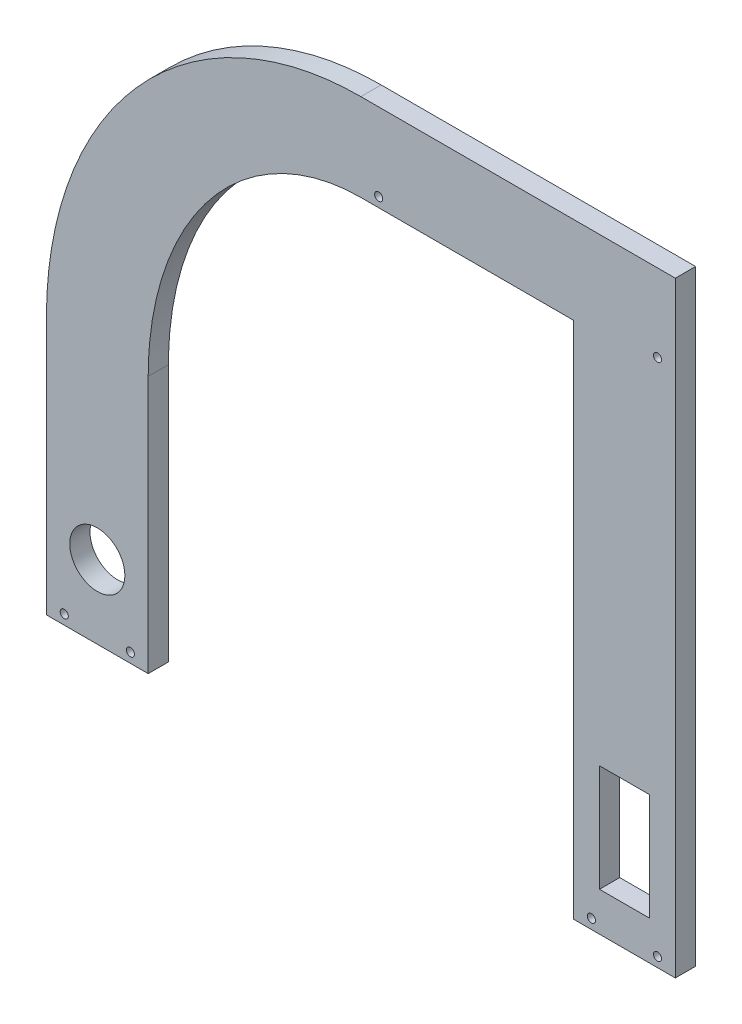
ISO-10303-21;
HEADER;
FILE_DESCRIPTION(('STEP AP214'),'2;1');
FILE_NAME('part.step','',(''),(''),'','','');
FILE_SCHEMA(('AUTOMOTIVE_DESIGN { 1 0 10303 214 1 1 1 1 }'));
ENDSEC;
DATA;
#1=APPLICATION_CONTEXT('core data for automotive mechanical design processes');
#2=APPLICATION_PROTOCOL_DEFINITION('international standard','automotive_design',2000,#1);
#3=PRODUCT_CONTEXT('',#1,'mechanical');
#4=PRODUCT('Part','Part','',(#3));
#5=PRODUCT_RELATED_PRODUCT_CATEGORY('part','',(#4));
#6=PRODUCT_DEFINITION_FORMATION('','',#4);
#7=PRODUCT_DEFINITION_CONTEXT('part definition',#1,'design');
#8=PRODUCT_DEFINITION('design','',#6,#7);
#9=PRODUCT_DEFINITION_SHAPE('','',#8);
#10=(LENGTH_UNIT() NAMED_UNIT(*) SI_UNIT(.MILLI.,.METRE.));
#11=(NAMED_UNIT(*) PLANE_ANGLE_UNIT() SI_UNIT($,.RADIAN.));
#12=(NAMED_UNIT(*) SI_UNIT($,.STERADIAN.) SOLID_ANGLE_UNIT());
#13=UNCERTAINTY_MEASURE_WITH_UNIT(LENGTH_MEASURE(1.E-05),#10,'distance_accuracy_value','');
#14=(GEOMETRIC_REPRESENTATION_CONTEXT(3) GLOBAL_UNCERTAINTY_ASSIGNED_CONTEXT((#13)) GLOBAL_UNIT_ASSIGNED_CONTEXT((#10,
#11,#12)) REPRESENTATION_CONTEXT('',''));
#15=CARTESIAN_POINT('',(0.,0.,0.));
#16=DIRECTION('',(0.,0.,1.));
#17=DIRECTION('',(1.,0.,0.));
#18=AXIS2_PLACEMENT_3D('',#15,#16,#17);
#19=CARTESIAN_POINT('',(0.,0.,7.9375));
#20=DIRECTION('',(1.,0.,0.));
#21=DIRECTION('',(0.,0.,-1.));
#22=AXIS2_PLACEMENT_3D('',#19,#20,#21);
#23=PLANE('',#22);
#24=DIRECTION('',(0.,0.,1.));
#25=VECTOR('',#24,1.);
#26=CARTESIAN_POINT('',(0.,100.875137361259,-0.000999999999999265));
#27=LINE('',#26,#25);
#28=CARTESIAN_POINT('',(0.,100.875137361259,0.));
#29=VERTEX_POINT('',#28);
#30=CARTESIAN_POINT('',(0.,100.875137361259,7.9375));
#31=VERTEX_POINT('',#30);
#32=EDGE_CURVE('E363',#29,#31,#27,.T.);
#33=ORIENTED_EDGE('',*,*,#32,.F.);
#34=DIRECTION('',(0.,-1.,0.));
#35=VECTOR('',#34,1.);
#36=CARTESIAN_POINT('',(0.,0.,0.));
#37=LINE('',#36,#35);
#38=CARTESIAN_POINT('',(0.,0.,0.));
#39=VERTEX_POINT('',#38);
#40=EDGE_CURVE('E312',#29,#39,#37,.T.);
#41=ORIENTED_EDGE('',*,*,#40,.T.);
#42=DIRECTION('',(0.,0.,-1.));
#43=VECTOR('',#42,1.);
#44=CARTESIAN_POINT('',(0.,0.,7.9375));
#45=LINE('',#44,#43);
#46=CARTESIAN_POINT('',(0.,0.,7.9375));
#47=VERTEX_POINT('',#46);
#48=EDGE_CURVE('E11',#47,#39,#45,.T.);
#49=ORIENTED_EDGE('',*,*,#48,.F.);
#50=DIRECTION('',(0.,-1.,0.));
#51=VECTOR('',#50,1.);
#52=CARTESIAN_POINT('',(0.,0.,7.9375));
#53=LINE('',#52,#51);
#54=EDGE_CURVE('E313',#31,#47,#53,.T.);
#55=ORIENTED_EDGE('',*,*,#54,.F.);
#56=EDGE_LOOP('',(#33,#41,#49,#55));
#57=FACE_BOUND('',#56,.T.);
#58=ADVANCED_FACE('F38',(#57),#23,.F.);
#59=CARTESIAN_POINT('',(0.,0.,7.9375));
#60=DIRECTION('',(0.,1.,0.));
#61=DIRECTION('',(0.,0.,1.));
#62=AXIS2_PLACEMENT_3D('',#59,#60,#61);
#63=PLANE('',#62);
#64=DIRECTION('',(1.,0.,0.));
#65=VECTOR('',#64,1.);
#66=CARTESIAN_POINT('',(0.,0.,0.));
#67=LINE('',#66,#65);
#68=CARTESIAN_POINT('',(39.878,0.,0.));
#69=VERTEX_POINT('',#68);
#70=EDGE_CURVE('E329',#39,#69,#67,.T.);
#71=ORIENTED_EDGE('',*,*,#70,.T.);
#72=DIRECTION('',(0.,0.,1.));
#73=VECTOR('',#72,1.);
#74=CARTESIAN_POINT('',(39.878,0.,-0.000999999999999265));
#75=LINE('',#74,#73);
#76=CARTESIAN_POINT('',(39.878,0.,7.9375));
#77=VERTEX_POINT('',#76);
#78=EDGE_CURVE('E293',#69,#77,#75,.T.);
#79=ORIENTED_EDGE('',*,*,#78,.T.);
#80=DIRECTION('',(1.,0.,0.));
#81=VECTOR('',#80,1.);
#82=CARTESIAN_POINT('',(0.,0.,7.9375));
#83=LINE('',#82,#81);
#84=EDGE_CURVE('E318',#47,#77,#83,.T.);
#85=ORIENTED_EDGE('',*,*,#84,.F.);
#86=ORIENTED_EDGE('',*,*,#48,.T.);
#87=EDGE_LOOP('',(#71,#79,#85,#86));
#88=FACE_BOUND('',#87,.T.);
#89=ADVANCED_FACE('F374',(#88),#63,.F.);
#90=CARTESIAN_POINT('',(206.502,0.,7.9375));
#91=VERTEX_POINT('',#90);
#92=CARTESIAN_POINT('',(246.38,0.,7.9375));
#93=VERTEX_POINT('',#92);
#94=EDGE_CURVE('E316',#91,#93,#83,.T.);
#95=ORIENTED_EDGE('',*,*,#94,.F.);
#96=DIRECTION('',(0.,0.,1.));
#97=VECTOR('',#96,1.);
#98=CARTESIAN_POINT('',(206.502,0.,-0.000999999999999265));
#99=LINE('',#98,#97);
#100=CARTESIAN_POINT('',(206.502,0.,0.));
#101=VERTEX_POINT('',#100);
#102=EDGE_CURVE('E292',#101,#91,#99,.T.);
#103=ORIENTED_EDGE('',*,*,#102,.F.);
#104=CARTESIAN_POINT('',(246.38,0.,0.));
#105=VERTEX_POINT('',#104);
#106=EDGE_CURVE('E328',#101,#105,#67,.T.);
#107=ORIENTED_EDGE('',*,*,#106,.T.);
#108=DIRECTION('',(0.,0.,-1.));
#109=VECTOR('',#108,1.);
#110=CARTESIAN_POINT('',(246.38,0.,7.9375));
#111=LINE('',#110,#109);
#112=EDGE_CURVE('E46',#93,#105,#111,.T.);
#113=ORIENTED_EDGE('',*,*,#112,.F.);
#114=EDGE_LOOP('',(#95,#103,#107,#113));
#115=FACE_BOUND('',#114,.T.);
#116=ADVANCED_FACE('F390',(#115),#63,.F.);
#117=CARTESIAN_POINT('',(246.38,0.,7.9375));
#118=DIRECTION('',(-1.,0.,0.));
#119=DIRECTION('',(0.,0.,1.));
#120=AXIS2_PLACEMENT_3D('',#117,#118,#119);
#121=PLANE('',#120);
#122=DIRECTION('',(0.,1.,0.));
#123=VECTOR('',#122,1.);
#124=CARTESIAN_POINT('',(246.38,0.,0.));
#125=LINE('',#124,#123);
#126=CARTESIAN_POINT('',(246.38,237.422544344755,0.));
#127=VERTEX_POINT('',#126);
#128=EDGE_CURVE('E317',#105,#127,#125,.T.);
#129=ORIENTED_EDGE('',*,*,#128,.T.);
#130=DIRECTION('',(0.,0.,1.));
#131=VECTOR('',#130,1.);
#132=CARTESIAN_POINT('',(246.38,237.422544344755,-0.000999999999999265));
#133=LINE('',#132,#131);
#134=CARTESIAN_POINT('',(246.38,237.422544344755,7.9375));
#135=VERTEX_POINT('',#134);
#136=EDGE_CURVE('E352',#127,#135,#133,.T.);
#137=ORIENTED_EDGE('',*,*,#136,.T.);
#138=DIRECTION('',(0.,1.,0.));
#139=VECTOR('',#138,1.);
#140=CARTESIAN_POINT('',(246.38,0.,7.9375));
#141=LINE('',#140,#139);
#142=EDGE_CURVE('E322',#93,#135,#141,.T.);
#143=ORIENTED_EDGE('',*,*,#142,.F.);
#144=ORIENTED_EDGE('',*,*,#112,.T.);
#145=EDGE_LOOP('',(#129,#137,#143,#144));
#146=FACE_BOUND('',#145,.T.);
#147=ADVANCED_FACE('F341',(#146),#121,.F.);
#148=CARTESIAN_POINT('',(0.,0.,7.9375));
#149=DIRECTION('',(0.,0.,-1.));
#150=DIRECTION('',(-1.,0.,0.));
#151=AXIS2_PLACEMENT_3D('',#148,#149,#150);
#152=PLANE('',#151);
#153=DIRECTION('',(-1.,0.,0.));
#154=VECTOR('',#153,1.);
#155=CARTESIAN_POINT('',(236.22,57.15,7.9375));
#156=LINE('',#155,#154);
#157=CARTESIAN_POINT('',(236.22,57.15,7.9375));
#158=VERTEX_POINT('',#157);
#159=CARTESIAN_POINT('',(216.662,57.15,7.9375));
#160=VERTEX_POINT('',#159);
#161=EDGE_CURVE('E163',#158,#160,#156,.T.);
#162=ORIENTED_EDGE('',*,*,#161,.F.);
#163=DIRECTION('',(0.,1.,0.));
#164=VECTOR('',#163,1.);
#165=CARTESIAN_POINT('',(236.22,15.24,7.9375));
#166=LINE('',#165,#164);
#167=CARTESIAN_POINT('',(236.22,15.24,7.9375));
#168=VERTEX_POINT('',#167);
#169=EDGE_CURVE('E53',#168,#158,#166,.T.);
#170=ORIENTED_EDGE('',*,*,#169,.F.);
#171=DIRECTION('',(1.,0.,0.));
#172=VECTOR('',#171,1.);
#173=CARTESIAN_POINT('',(236.22,15.24,7.9375));
#174=LINE('',#173,#172);
#175=CARTESIAN_POINT('',(216.662,15.24,7.9375));
#176=VERTEX_POINT('',#175);
#177=EDGE_CURVE('E153',#176,#168,#174,.T.);
#178=ORIENTED_EDGE('',*,*,#177,.F.);
#179=DIRECTION('',(0.,-1.,0.));
#180=VECTOR('',#179,1.);
#181=CARTESIAN_POINT('',(216.662,15.24,7.9375));
#182=LINE('',#181,#180);
#183=EDGE_CURVE('E171',#160,#176,#182,.T.);
#184=ORIENTED_EDGE('',*,*,#183,.F.);
#185=EDGE_LOOP('',(#162,#170,#178,#184));
#186=FACE_BOUND('',#185,.T.);
#187=CARTESIAN_POINT('',(19.9390000000006,28.7020000000001,7.9375));
#188=DIRECTION('',(0.,0.,1.));
#189=DIRECTION('',(1.,0.,0.));
#190=AXIS2_PLACEMENT_3D('',#187,#188,#189);
#191=CIRCLE('',#190,10.795);
#192=CARTESIAN_POINT('',(30.7340000000006,28.7020000000001,7.9375));
#193=VERTEX_POINT('',#192);
#194=EDGE_CURVE('E185',#193,#193,#191,.T.);
#195=ORIENTED_EDGE('',*,*,#194,.F.);
#196=EDGE_LOOP('',(#195));
#197=FACE_BOUND('',#196,.T.);
#198=CARTESIAN_POINT('',(6.98500000000003,3.80999999999999,7.9375));
#199=DIRECTION('',(0.,0.,1.));
#200=DIRECTION('',(1.,0.,0.));
#201=AXIS2_PLACEMENT_3D('',#198,#199,#200);
#202=CIRCLE('',#201,1.5875);
#203=CARTESIAN_POINT('',(8.57250000000003,3.80999999999999,7.9375));
#204=VERTEX_POINT('',#203);
#205=EDGE_CURVE('E193',#204,#204,#202,.T.);
#206=ORIENTED_EDGE('',*,*,#205,.F.);
#207=EDGE_LOOP('',(#206));
#208=FACE_BOUND('',#207,.T.);
#209=CARTESIAN_POINT('',(239.395,207.01,7.9375));
#210=DIRECTION('',(0.,0.,1.));
#211=DIRECTION('',(1.,0.,0.));
#212=AXIS2_PLACEMENT_3D('',#209,#210,#211);
#213=CIRCLE('',#212,1.58749999999999);
#214=CARTESIAN_POINT('',(240.9825,207.01,7.9375));
#215=VERTEX_POINT('',#214);
#216=EDGE_CURVE('E203',#215,#215,#213,.T.);
#217=ORIENTED_EDGE('',*,*,#216,.F.);
#218=EDGE_LOOP('',(#217));
#219=FACE_BOUND('',#218,.T.);
#220=CARTESIAN_POINT('',(32.893,3.80999999999999,7.9375));
#221=DIRECTION('',(0.,0.,1.));
#222=DIRECTION('',(1.,0.,0.));
#223=AXIS2_PLACEMENT_3D('',#220,#221,#222);
#224=CIRCLE('',#223,1.5875);
#225=CARTESIAN_POINT('',(34.4805,3.80999999999999,7.9375));
#226=VERTEX_POINT('',#225);
#227=EDGE_CURVE('E202',#226,#226,#224,.T.);
#228=ORIENTED_EDGE('',*,*,#227,.F.);
#229=EDGE_LOOP('',(#228));
#230=FACE_BOUND('',#229,.T.);
#231=CARTESIAN_POINT('',(213.487,3.81,7.9375));
#232=DIRECTION('',(0.,0.,1.));
#233=DIRECTION('',(1.,0.,0.));
#234=AXIS2_PLACEMENT_3D('',#231,#232,#233);
#235=CIRCLE('',#234,1.58749999999999);
#236=CARTESIAN_POINT('',(215.0745,3.81,7.9375));
#237=VERTEX_POINT('',#236);
#238=EDGE_CURVE('E234',#237,#237,#235,.T.);
#239=ORIENTED_EDGE('',*,*,#238,.F.);
#240=EDGE_LOOP('',(#239));
#241=FACE_BOUND('',#240,.T.);
#242=CARTESIAN_POINT('',(239.395,3.81,7.9375));
#243=DIRECTION('',(0.,0.,1.));
#244=DIRECTION('',(1.,0.,0.));
#245=AXIS2_PLACEMENT_3D('',#242,#243,#244);
#246=CIRCLE('',#245,1.58749999999999);
#247=CARTESIAN_POINT('',(240.9825,3.81,7.9375));
#248=VERTEX_POINT('',#247);
#249=EDGE_CURVE('E211',#248,#248,#246,.T.);
#250=ORIENTED_EDGE('',*,*,#249,.F.);
#251=EDGE_LOOP('',(#250));
#252=FACE_BOUND('',#251,.T.);
#253=CARTESIAN_POINT('',(130.175,207.01,7.9375));
#254=DIRECTION('',(0.,0.,1.));
#255=DIRECTION('',(1.,0.,0.));
#256=AXIS2_PLACEMENT_3D('',#253,#254,#255);
#257=CIRCLE('',#256,1.58749999999999);
#258=CARTESIAN_POINT('',(131.7625,207.01,7.9375));
#259=VERTEX_POINT('',#258);
#260=EDGE_CURVE('E220',#259,#259,#257,.T.);
#261=ORIENTED_EDGE('',*,*,#260,.F.);
#262=EDGE_LOOP('',(#261));
#263=FACE_BOUND('',#262,.T.);
#264=ORIENTED_EDGE('',*,*,#142,.T.);
#265=DIRECTION('',(1.,0.,0.));
#266=VECTOR('',#265,1.);
#267=CARTESIAN_POINT('',(123.19,237.422544344755,7.9375));
#268=LINE('',#267,#266);
#269=CARTESIAN_POINT('',(123.19,237.422544344755,7.9375));
#270=VERTEX_POINT('',#269);
#271=EDGE_CURVE('E354',#270,#135,#268,.T.);
#272=ORIENTED_EDGE('',*,*,#271,.F.);
#273=CARTESIAN_POINT('',(123.19,100.875137361259,7.9375));
#274=DIRECTION('',(0.,0.,-1.));
#275=DIRECTION('',(0.,1.,0.));
#276=AXIS2_PLACEMENT_3D('',#273,#274,#275);
#277=ELLIPSE('',#276,136.547406983496,123.19);
#278=EDGE_CURVE('E248',#31,#270,#277,.T.);
#279=ORIENTED_EDGE('',*,*,#278,.F.);
#280=ORIENTED_EDGE('',*,*,#54,.T.);
#281=ORIENTED_EDGE('',*,*,#84,.T.);
#282=DIRECTION('',(0.,-1.,0.));
#283=VECTOR('',#282,1.);
#284=CARTESIAN_POINT('',(39.878,0.,7.9375));
#285=LINE('',#284,#283);
#286=CARTESIAN_POINT('',(39.878,100.875137361259,7.9375));
#287=VERTEX_POINT('',#286);
#288=EDGE_CURVE('E289',#287,#77,#285,.T.);
#289=ORIENTED_EDGE('',*,*,#288,.F.);
#290=CARTESIAN_POINT('',(123.19,100.875137361259,7.9375));
#291=DIRECTION('',(0.,0.,1.));
#292=DIRECTION('',(0.,1.,0.));
#293=AXIS2_PLACEMENT_3D('',#290,#291,#292);
#294=ELLIPSE('',#293,102.324862638741,83.312);
#295=CARTESIAN_POINT('',(123.19,203.2,7.9375));
#296=VERTEX_POINT('',#295);
#297=EDGE_CURVE('E285',#296,#287,#294,.T.);
#298=ORIENTED_EDGE('',*,*,#297,.F.);
#299=DIRECTION('',(-1.,0.,0.));
#300=VECTOR('',#299,1.);
#301=CARTESIAN_POINT('',(123.19,203.2,7.9375));
#302=LINE('',#301,#300);
#303=CARTESIAN_POINT('',(206.502,203.2,7.9375));
#304=VERTEX_POINT('',#303);
#305=EDGE_CURVE('E281',#304,#296,#302,.T.);
#306=ORIENTED_EDGE('',*,*,#305,.F.);
#307=DIRECTION('',(0.,1.,0.));
#308=VECTOR('',#307,1.);
#309=CARTESIAN_POINT('',(206.502,203.2,7.9375));
#310=LINE('',#309,#308);
#311=EDGE_CURVE('E277',#91,#304,#310,.T.);
#312=ORIENTED_EDGE('',*,*,#311,.F.);
#313=ORIENTED_EDGE('',*,*,#94,.T.);
#314=EDGE_LOOP('',(#264,#272,#279,#280,#281,#289,#298,#306,#312,#313));
#315=FACE_BOUND('',#314,.T.);
#316=ADVANCED_FACE('F382',(#186,#197,#208,#219,#230,#241,#252,#263,#315),#152,.F.);
#317=CARTESIAN_POINT('',(0.,0.,0.));
#318=DIRECTION('',(0.,0.,-1.));
#319=DIRECTION('',(-1.,0.,0.));
#320=AXIS2_PLACEMENT_3D('',#317,#318,#319);
#321=PLANE('',#320);
#322=DIRECTION('',(0.,1.,0.));
#323=VECTOR('',#322,1.);
#324=CARTESIAN_POINT('',(236.22,15.24,0.));
#325=LINE('',#324,#323);
#326=CARTESIAN_POINT('',(236.22,15.24,0.));
#327=VERTEX_POINT('',#326);
#328=CARTESIAN_POINT('',(236.22,57.15,0.));
#329=VERTEX_POINT('',#328);
#330=EDGE_CURVE('E150',#327,#329,#325,.T.);
#331=ORIENTED_EDGE('',*,*,#330,.T.);
#332=DIRECTION('',(-1.,0.,0.));
#333=VECTOR('',#332,1.);
#334=CARTESIAN_POINT('',(236.22,57.15,0.));
#335=LINE('',#334,#333);
#336=CARTESIAN_POINT('',(216.662,57.15,0.));
#337=VERTEX_POINT('',#336);
#338=EDGE_CURVE('E138',#329,#337,#335,.T.);
#339=ORIENTED_EDGE('',*,*,#338,.T.);
#340=DIRECTION('',(0.,-1.,0.));
#341=VECTOR('',#340,1.);
#342=CARTESIAN_POINT('',(216.662,15.24,0.));
#343=LINE('',#342,#341);
#344=CARTESIAN_POINT('',(216.662,15.24,0.));
#345=VERTEX_POINT('',#344);
#346=EDGE_CURVE('E165',#337,#345,#343,.T.);
#347=ORIENTED_EDGE('',*,*,#346,.T.);
#348=DIRECTION('',(1.,0.,0.));
#349=VECTOR('',#348,1.);
#350=CARTESIAN_POINT('',(236.22,15.24,0.));
#351=LINE('',#350,#349);
#352=EDGE_CURVE('E158',#345,#327,#351,.T.);
#353=ORIENTED_EDGE('',*,*,#352,.T.);
#354=EDGE_LOOP('',(#331,#339,#347,#353));
#355=FACE_BOUND('',#354,.T.);
#356=CARTESIAN_POINT('',(19.9390000000006,28.7020000000001,0.));
#357=DIRECTION('',(0.,0.,-1.));
#358=DIRECTION('',(-1.,0.,0.));
#359=AXIS2_PLACEMENT_3D('',#356,#357,#358);
#360=CIRCLE('',#359,10.795);
#361=CARTESIAN_POINT('',(9.14400000000064,28.7020000000001,0.));
#362=VERTEX_POINT('',#361);
#363=EDGE_CURVE('E146',#362,#362,#360,.F.);
#364=ORIENTED_EDGE('',*,*,#363,.T.);
#365=EDGE_LOOP('',(#364));
#366=FACE_BOUND('',#365,.T.);
#367=CARTESIAN_POINT('',(6.98500000000003,3.80999999999999,0.));
#368=DIRECTION('',(0.,0.,-1.));
#369=DIRECTION('',(-1.,0.,0.));
#370=AXIS2_PLACEMENT_3D('',#367,#368,#369);
#371=CIRCLE('',#370,1.5875);
#372=CARTESIAN_POINT('',(5.39750000000003,3.80999999999999,0.));
#373=VERTEX_POINT('',#372);
#374=EDGE_CURVE('E198',#373,#373,#371,.F.);
#375=ORIENTED_EDGE('',*,*,#374,.T.);
#376=EDGE_LOOP('',(#375));
#377=FACE_BOUND('',#376,.T.);
#378=CARTESIAN_POINT('',(239.395,207.01,0.));
#379=DIRECTION('',(0.,0.,-1.));
#380=DIRECTION('',(-1.,0.,0.));
#381=AXIS2_PLACEMENT_3D('',#378,#379,#380);
#382=CIRCLE('',#381,1.58749999999999);
#383=CARTESIAN_POINT('',(237.8075,207.01,0.));
#384=VERTEX_POINT('',#383);
#385=EDGE_CURVE('E189',#384,#384,#382,.F.);
#386=ORIENTED_EDGE('',*,*,#385,.T.);
#387=EDGE_LOOP('',(#386));
#388=FACE_BOUND('',#387,.T.);
#389=CARTESIAN_POINT('',(32.893,3.80999999999999,0.));
#390=DIRECTION('',(0.,0.,-1.));
#391=DIRECTION('',(-1.,0.,0.));
#392=AXIS2_PLACEMENT_3D('',#389,#390,#391);
#393=CIRCLE('',#392,1.5875);
#394=CARTESIAN_POINT('',(31.3055,3.80999999999999,0.));
#395=VERTEX_POINT('',#394);
#396=EDGE_CURVE('E230',#395,#395,#393,.F.);
#397=ORIENTED_EDGE('',*,*,#396,.T.);
#398=EDGE_LOOP('',(#397));
#399=FACE_BOUND('',#398,.T.);
#400=CARTESIAN_POINT('',(213.487,3.81,0.));
#401=DIRECTION('',(0.,0.,-1.));
#402=DIRECTION('',(-1.,0.,0.));
#403=AXIS2_PLACEMENT_3D('',#400,#401,#402);
#404=CIRCLE('',#403,1.58749999999999);
#405=CARTESIAN_POINT('',(211.8995,3.81,0.));
#406=VERTEX_POINT('',#405);
#407=EDGE_CURVE('E215',#406,#406,#404,.F.);
#408=ORIENTED_EDGE('',*,*,#407,.T.);
#409=EDGE_LOOP('',(#408));
#410=FACE_BOUND('',#409,.T.);
#411=CARTESIAN_POINT('',(239.395,3.81,0.));
#412=DIRECTION('',(0.,0.,-1.));
#413=DIRECTION('',(-1.,0.,0.));
#414=AXIS2_PLACEMENT_3D('',#411,#412,#413);
#415=CIRCLE('',#414,1.58749999999999);
#416=CARTESIAN_POINT('',(237.8075,3.81,0.));
#417=VERTEX_POINT('',#416);
#418=EDGE_CURVE('E216',#417,#417,#415,.F.);
#419=ORIENTED_EDGE('',*,*,#418,.T.);
#420=EDGE_LOOP('',(#419));
#421=FACE_BOUND('',#420,.T.);
#422=CARTESIAN_POINT('',(130.175,207.01,0.));
#423=DIRECTION('',(0.,0.,-1.));
#424=DIRECTION('',(-1.,0.,0.));
#425=AXIS2_PLACEMENT_3D('',#422,#423,#424);
#426=CIRCLE('',#425,1.58749999999999);
#427=CARTESIAN_POINT('',(128.5875,207.01,0.));
#428=VERTEX_POINT('',#427);
#429=EDGE_CURVE('E207',#428,#428,#426,.F.);
#430=ORIENTED_EDGE('',*,*,#429,.T.);
#431=EDGE_LOOP('',(#430));
#432=FACE_BOUND('',#431,.T.);
#433=DIRECTION('',(1.,0.,0.));
#434=VECTOR('',#433,1.);
#435=CARTESIAN_POINT('',(123.19,237.422544344755,0.));
#436=LINE('',#435,#434);
#437=CARTESIAN_POINT('',(123.19,237.422544344755,0.));
#438=VERTEX_POINT('',#437);
#439=EDGE_CURVE('E244',#438,#127,#436,.T.);
#440=ORIENTED_EDGE('',*,*,#439,.T.);
#441=ORIENTED_EDGE('',*,*,#128,.F.);
#442=ORIENTED_EDGE('',*,*,#106,.F.);
#443=DIRECTION('',(0.,1.,0.));
#444=VECTOR('',#443,1.);
#445=CARTESIAN_POINT('',(206.502,203.2,0.));
#446=LINE('',#445,#444);
#447=CARTESIAN_POINT('',(206.502,203.2,0.));
#448=VERTEX_POINT('',#447);
#449=EDGE_CURVE('E297',#101,#448,#446,.T.);
#450=ORIENTED_EDGE('',*,*,#449,.T.);
#451=DIRECTION('',(-1.,0.,0.));
#452=VECTOR('',#451,1.);
#453=CARTESIAN_POINT('',(123.19,203.2,0.));
#454=LINE('',#453,#452);
#455=CARTESIAN_POINT('',(123.19,203.2,0.));
#456=VERTEX_POINT('',#455);
#457=EDGE_CURVE('E356',#448,#456,#454,.T.);
#458=ORIENTED_EDGE('',*,*,#457,.T.);
#459=CARTESIAN_POINT('',(123.19,100.875137361259,0.));
#460=DIRECTION('',(0.,0.,1.));
#461=DIRECTION('',(0.,1.,0.));
#462=AXIS2_PLACEMENT_3D('',#459,#460,#461);
#463=ELLIPSE('',#462,102.324862638741,83.312);
#464=CARTESIAN_POINT('',(39.878,100.875137361259,0.));
#465=VERTEX_POINT('',#464);
#466=EDGE_CURVE('E361',#456,#465,#463,.T.);
#467=ORIENTED_EDGE('',*,*,#466,.T.);
#468=DIRECTION('',(0.,-1.,0.));
#469=VECTOR('',#468,1.);
#470=CARTESIAN_POINT('',(39.878,0.,0.));
#471=LINE('',#470,#469);
#472=EDGE_CURVE('E275',#465,#69,#471,.T.);
#473=ORIENTED_EDGE('',*,*,#472,.T.);
#474=ORIENTED_EDGE('',*,*,#70,.F.);
#475=ORIENTED_EDGE('',*,*,#40,.F.);
#476=CARTESIAN_POINT('',(123.19,100.875137361259,0.));
#477=DIRECTION('',(0.,0.,-1.));
#478=DIRECTION('',(0.,1.,0.));
#479=AXIS2_PLACEMENT_3D('',#476,#477,#478);
#480=ELLIPSE('',#479,136.547406983496,123.19);
#481=EDGE_CURVE('E197',#29,#438,#480,.T.);
#482=ORIENTED_EDGE('',*,*,#481,.T.);
#483=EDGE_LOOP('',(#440,#441,#442,#450,#458,#467,#473,#474,#475,#482));
#484=FACE_BOUND('',#483,.T.);
#485=ADVANCED_FACE('F156',(#355,#366,#377,#388,#399,#410,#421,#432,#484),#321,.T.);
#486=CARTESIAN_POINT('',(39.878,0.,-0.000999999999999265));
#487=DIRECTION('',(-1.,0.,0.));
#488=DIRECTION('',(0.,-1.,0.));
#489=AXIS2_PLACEMENT_3D('',#486,#487,#488);
#490=PLANE('',#489);
#491=DIRECTION('',(0.,0.,1.));
#492=VECTOR('',#491,1.);
#493=CARTESIAN_POINT('',(39.878,100.875137361259,-0.000999999999999265));
#494=LINE('',#493,#492);
#495=EDGE_CURVE('E298',#465,#287,#494,.T.);
#496=ORIENTED_EDGE('',*,*,#495,.T.);
#497=ORIENTED_EDGE('',*,*,#288,.T.);
#498=ORIENTED_EDGE('',*,*,#78,.F.);
#499=ORIENTED_EDGE('',*,*,#472,.F.);
#500=EDGE_LOOP('',(#496,#497,#498,#499));
#501=FACE_BOUND('',#500,.T.);
#502=ADVANCED_FACE('F261',(#501),#490,.F.);
#503=CARTESIAN_POINT('',(123.19,100.875137361259,-0.000999999999999265));
#504=DIRECTION('',(0.,0.,1.));
#505=DIRECTION('',(0.,1.,0.));
#506=AXIS2_PLACEMENT_3D('',#503,#504,#505);
#507=ELLIPSE('',#506,102.324862638741,83.312);
#508=DIRECTION('',(0.,0.,1.));
#509=VECTOR('',#508,1.);
#510=SURFACE_OF_LINEAR_EXTRUSION('',#507,#509);
#511=DIRECTION('',(0.,0.,1.));
#512=VECTOR('',#511,1.);
#513=CARTESIAN_POINT('',(123.19,203.2,-0.000999999999999265));
#514=LINE('',#513,#512);
#515=EDGE_CURVE('E301',#456,#296,#514,.T.);
#516=ORIENTED_EDGE('',*,*,#515,.T.);
#517=ORIENTED_EDGE('',*,*,#297,.T.);
#518=ORIENTED_EDGE('',*,*,#495,.F.);
#519=ORIENTED_EDGE('',*,*,#466,.F.);
#520=EDGE_LOOP('',(#516,#517,#518,#519));
#521=FACE_BOUND('',#520,.T.);
#522=ADVANCED_FACE('F264',(#521),#510,.F.);
#523=CARTESIAN_POINT('',(123.19,203.2,-0.000999999999999265));
#524=DIRECTION('',(0.,1.,0.));
#525=DIRECTION('',(0.,0.,1.));
#526=AXIS2_PLACEMENT_3D('',#523,#524,#525);
#527=PLANE('',#526);
#528=DIRECTION('',(0.,0.,1.));
#529=VECTOR('',#528,1.);
#530=CARTESIAN_POINT('',(206.502,203.2,-0.000999999999999265));
#531=LINE('',#530,#529);
#532=EDGE_CURVE('E304',#448,#304,#531,.T.);
#533=ORIENTED_EDGE('',*,*,#532,.T.);
#534=ORIENTED_EDGE('',*,*,#305,.T.);
#535=ORIENTED_EDGE('',*,*,#515,.F.);
#536=ORIENTED_EDGE('',*,*,#457,.F.);
#537=EDGE_LOOP('',(#533,#534,#535,#536));
#538=FACE_BOUND('',#537,.T.);
#539=ADVANCED_FACE('F269',(#538),#527,.F.);
#540=CARTESIAN_POINT('',(206.502,203.2,-0.000999999999999265));
#541=DIRECTION('',(1.,0.,0.));
#542=DIRECTION('',(0.,0.,-1.));
#543=AXIS2_PLACEMENT_3D('',#540,#541,#542);
#544=PLANE('',#543);
#545=ORIENTED_EDGE('',*,*,#102,.T.);
#546=ORIENTED_EDGE('',*,*,#311,.T.);
#547=ORIENTED_EDGE('',*,*,#532,.F.);
#548=ORIENTED_EDGE('',*,*,#449,.F.);
#549=EDGE_LOOP('',(#545,#546,#547,#548));
#550=FACE_BOUND('',#549,.T.);
#551=ADVANCED_FACE('F392',(#550),#544,.F.);
#552=CARTESIAN_POINT('',(123.19,237.422544344755,-0.000999999999999265));
#553=DIRECTION('',(0.,-1.,0.));
#554=DIRECTION('',(0.,0.,-1.));
#555=AXIS2_PLACEMENT_3D('',#552,#553,#554);
#556=PLANE('',#555);
#557=DIRECTION('',(0.,0.,1.));
#558=VECTOR('',#557,1.);
#559=CARTESIAN_POINT('',(123.19,237.422544344755,-0.000999999999999265));
#560=LINE('',#559,#558);
#561=EDGE_CURVE('E350',#438,#270,#560,.T.);
#562=ORIENTED_EDGE('',*,*,#561,.T.);
#563=ORIENTED_EDGE('',*,*,#271,.T.);
#564=ORIENTED_EDGE('',*,*,#136,.F.);
#565=ORIENTED_EDGE('',*,*,#439,.F.);
#566=EDGE_LOOP('',(#562,#563,#564,#565));
#567=FACE_BOUND('',#566,.T.);
#568=ADVANCED_FACE('F258',(#567),#556,.F.);
#569=CARTESIAN_POINT('',(123.19,100.875137361259,-0.000999999999999265));
#570=DIRECTION('',(0.,0.,-1.));
#571=DIRECTION('',(0.,1.,0.));
#572=AXIS2_PLACEMENT_3D('',#569,#570,#571);
#573=ELLIPSE('',#572,136.547406983496,123.19);
#574=DIRECTION('',(0.,0.,1.));
#575=VECTOR('',#574,1.);
#576=SURFACE_OF_LINEAR_EXTRUSION('',#573,#575);
#577=ORIENTED_EDGE('',*,*,#32,.T.);
#578=ORIENTED_EDGE('',*,*,#278,.T.);
#579=ORIENTED_EDGE('',*,*,#561,.F.);
#580=ORIENTED_EDGE('',*,*,#481,.F.);
#581=EDGE_LOOP('',(#577,#578,#579,#580));
#582=FACE_BOUND('',#581,.T.);
#583=ADVANCED_FACE('F253',(#582),#576,.F.);
#584=CARTESIAN_POINT('',(130.175,207.01,-0.000999999999999265));
#585=DIRECTION('',(0.,0.,1.));
#586=DIRECTION('',(1.,0.,0.));
#587=AXIS2_PLACEMENT_3D('',#584,#585,#586);
#588=CYLINDRICAL_SURFACE('',#587,1.58749999999999);
#589=ORIENTED_EDGE('',*,*,#429,.F.);
#590=EDGE_LOOP('',(#589));
#591=FACE_BOUND('',#590,.T.);
#592=ORIENTED_EDGE('',*,*,#260,.T.);
#593=EDGE_LOOP('',(#592));
#594=FACE_BOUND('',#593,.T.);
#595=ADVANCED_FACE('F257',(#591,#594),#588,.F.);
#596=CARTESIAN_POINT('',(239.395,3.81,-0.000999999999999265));
#597=DIRECTION('',(0.,0.,1.));
#598=DIRECTION('',(1.,0.,0.));
#599=AXIS2_PLACEMENT_3D('',#596,#597,#598);
#600=CYLINDRICAL_SURFACE('',#599,1.58749999999999);
#601=ORIENTED_EDGE('',*,*,#418,.F.);
#602=EDGE_LOOP('',(#601));
#603=FACE_BOUND('',#602,.T.);
#604=ORIENTED_EDGE('',*,*,#249,.T.);
#605=EDGE_LOOP('',(#604));
#606=FACE_BOUND('',#605,.T.);
#607=ADVANCED_FACE('F435',(#603,#606),#600,.F.);
#608=CARTESIAN_POINT('',(213.487,3.81,-0.000999999999999265));
#609=DIRECTION('',(0.,0.,1.));
#610=DIRECTION('',(1.,0.,0.));
#611=AXIS2_PLACEMENT_3D('',#608,#609,#610);
#612=CYLINDRICAL_SURFACE('',#611,1.58749999999999);
#613=ORIENTED_EDGE('',*,*,#407,.F.);
#614=EDGE_LOOP('',(#613));
#615=FACE_BOUND('',#614,.T.);
#616=ORIENTED_EDGE('',*,*,#238,.T.);
#617=EDGE_LOOP('',(#616));
#618=FACE_BOUND('',#617,.T.);
#619=ADVANCED_FACE('F441',(#615,#618),#612,.F.);
#620=CARTESIAN_POINT('',(32.893,3.80999999999999,-0.000999999999999265));
#621=DIRECTION('',(0.,0.,1.));
#622=DIRECTION('',(1.,0.,0.));
#623=AXIS2_PLACEMENT_3D('',#620,#621,#622);
#624=CYLINDRICAL_SURFACE('',#623,1.5875);
#625=ORIENTED_EDGE('',*,*,#396,.F.);
#626=EDGE_LOOP('',(#625));
#627=FACE_BOUND('',#626,.T.);
#628=ORIENTED_EDGE('',*,*,#227,.T.);
#629=EDGE_LOOP('',(#628));
#630=FACE_BOUND('',#629,.T.);
#631=ADVANCED_FACE('F447',(#627,#630),#624,.F.);
#632=CARTESIAN_POINT('',(239.395,207.01,-0.000999999999999265));
#633=DIRECTION('',(0.,0.,1.));
#634=DIRECTION('',(1.,0.,0.));
#635=AXIS2_PLACEMENT_3D('',#632,#633,#634);
#636=CYLINDRICAL_SURFACE('',#635,1.58749999999999);
#637=ORIENTED_EDGE('',*,*,#385,.F.);
#638=EDGE_LOOP('',(#637));
#639=FACE_BOUND('',#638,.T.);
#640=ORIENTED_EDGE('',*,*,#216,.T.);
#641=EDGE_LOOP('',(#640));
#642=FACE_BOUND('',#641,.T.);
#643=ADVANCED_FACE('F449',(#639,#642),#636,.F.);
#644=CARTESIAN_POINT('',(6.98500000000003,3.80999999999999,-0.000999999999999265));
#645=DIRECTION('',(0.,0.,1.));
#646=DIRECTION('',(1.,0.,0.));
#647=AXIS2_PLACEMENT_3D('',#644,#645,#646);
#648=CYLINDRICAL_SURFACE('',#647,1.5875);
#649=ORIENTED_EDGE('',*,*,#374,.F.);
#650=EDGE_LOOP('',(#649));
#651=FACE_BOUND('',#650,.T.);
#652=ORIENTED_EDGE('',*,*,#205,.T.);
#653=EDGE_LOOP('',(#652));
#654=FACE_BOUND('',#653,.T.);
#655=ADVANCED_FACE('F474',(#651,#654),#648,.F.);
#656=CARTESIAN_POINT('',(19.9390000000006,28.7020000000001,-0.000999999999999265));
#657=DIRECTION('',(0.,0.,1.));
#658=DIRECTION('',(1.,0.,0.));
#659=AXIS2_PLACEMENT_3D('',#656,#657,#658);
#660=CYLINDRICAL_SURFACE('',#659,10.795);
#661=ORIENTED_EDGE('',*,*,#363,.F.);
#662=EDGE_LOOP('',(#661));
#663=FACE_BOUND('',#662,.T.);
#664=ORIENTED_EDGE('',*,*,#194,.T.);
#665=EDGE_LOOP('',(#664));
#666=FACE_BOUND('',#665,.T.);
#667=ADVANCED_FACE('F481',(#663,#666),#660,.F.);
#668=CARTESIAN_POINT('',(236.22,15.24,-0.000999999999999265));
#669=DIRECTION('',(1.,0.,0.));
#670=DIRECTION('',(0.,0.,-1.));
#671=AXIS2_PLACEMENT_3D('',#668,#669,#670);
#672=PLANE('',#671);
#673=DIRECTION('',(0.,0.,1.));
#674=VECTOR('',#673,1.);
#675=CARTESIAN_POINT('',(236.22,15.24,-0.000999999999999265));
#676=LINE('',#675,#674);
#677=EDGE_CURVE('E147',#327,#168,#676,.T.);
#678=ORIENTED_EDGE('',*,*,#677,.T.);
#679=ORIENTED_EDGE('',*,*,#169,.T.);
#680=DIRECTION('',(0.,0.,1.));
#681=VECTOR('',#680,1.);
#682=CARTESIAN_POINT('',(236.22,57.15,-0.000999999999999265));
#683=LINE('',#682,#681);
#684=EDGE_CURVE('E140',#329,#158,#683,.T.);
#685=ORIENTED_EDGE('',*,*,#684,.F.);
#686=ORIENTED_EDGE('',*,*,#330,.F.);
#687=EDGE_LOOP('',(#678,#679,#685,#686));
#688=FACE_BOUND('',#687,.T.);
#689=ADVANCED_FACE('F149',(#688),#672,.F.);
#690=CARTESIAN_POINT('',(236.22,15.24,-0.000999999999999265));
#691=DIRECTION('',(0.,-1.,0.));
#692=DIRECTION('',(1.,0.,0.));
#693=AXIS2_PLACEMENT_3D('',#690,#691,#692);
#694=PLANE('',#693);
#695=DIRECTION('',(0.,0.,1.));
#696=VECTOR('',#695,1.);
#697=CARTESIAN_POINT('',(216.662,15.24,-0.000999999999999265));
#698=LINE('',#697,#696);
#699=EDGE_CURVE('E180',#345,#176,#698,.T.);
#700=ORIENTED_EDGE('',*,*,#699,.T.);
#701=ORIENTED_EDGE('',*,*,#177,.T.);
#702=ORIENTED_EDGE('',*,*,#677,.F.);
#703=ORIENTED_EDGE('',*,*,#352,.F.);
#704=EDGE_LOOP('',(#700,#701,#702,#703));
#705=FACE_BOUND('',#704,.T.);
#706=ADVANCED_FACE('F496',(#705),#694,.F.);
#707=CARTESIAN_POINT('',(216.662,15.24,-0.000999999999999265));
#708=DIRECTION('',(-1.,0.,0.));
#709=DIRECTION('',(0.,0.,1.));
#710=AXIS2_PLACEMENT_3D('',#707,#708,#709);
#711=PLANE('',#710);
#712=DIRECTION('',(0.,0.,1.));
#713=VECTOR('',#712,1.);
#714=CARTESIAN_POINT('',(216.662,57.15,-0.000999999999999265));
#715=LINE('',#714,#713);
#716=EDGE_CURVE('E61',#337,#160,#715,.T.);
#717=ORIENTED_EDGE('',*,*,#716,.T.);
#718=ORIENTED_EDGE('',*,*,#183,.T.);
#719=ORIENTED_EDGE('',*,*,#699,.F.);
#720=ORIENTED_EDGE('',*,*,#346,.F.);
#721=EDGE_LOOP('',(#717,#718,#719,#720));
#722=FACE_BOUND('',#721,.T.);
#723=ADVANCED_FACE('F504',(#722),#711,.F.);
#724=CARTESIAN_POINT('',(236.22,57.15,-0.000999999999999265));
#725=DIRECTION('',(0.,1.,0.));
#726=DIRECTION('',(0.,0.,1.));
#727=AXIS2_PLACEMENT_3D('',#724,#725,#726);
#728=PLANE('',#727);
#729=ORIENTED_EDGE('',*,*,#684,.T.);
#730=ORIENTED_EDGE('',*,*,#161,.T.);
#731=ORIENTED_EDGE('',*,*,#716,.F.);
#732=ORIENTED_EDGE('',*,*,#338,.F.);
#733=EDGE_LOOP('',(#729,#730,#731,#732));
#734=FACE_BOUND('',#733,.T.);
#735=ADVANCED_FACE('F139',(#734),#728,.F.);
#736=CLOSED_SHELL('',(#58,#89,#116,#147,#316,#485,#502,#522,#539,#551,#568,#583,#595,#607,#619,
#631,#643,#655,#667,#689,#706,#723,#735));
#737=MANIFOLD_SOLID_BREP('B2',#736);
#738=ADVANCED_BREP_SHAPE_REPRESENTATION('',(#18,#737),#14);
#739=SHAPE_DEFINITION_REPRESENTATION(#9,#738);
ENDSEC;
END-ISO-10303-21;
